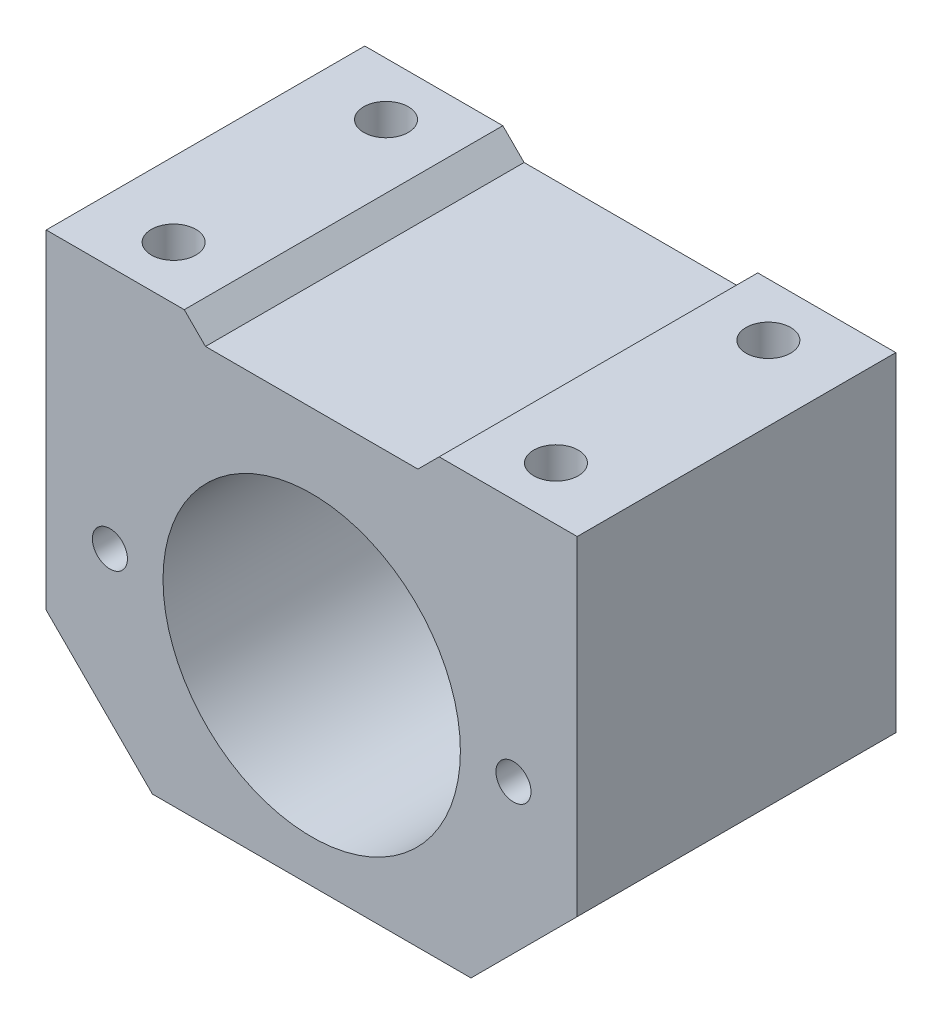
ISO-10303-21;
HEADER;
FILE_DESCRIPTION(('STEP AP214'),'2;1');
FILE_NAME('part.step','',(''),(''),'','','');
FILE_SCHEMA(('AUTOMOTIVE_DESIGN { 1 0 10303 214 1 1 1 1 }'));
ENDSEC;
DATA;
#1=APPLICATION_CONTEXT('core data for automotive mechanical design processes');
#2=APPLICATION_PROTOCOL_DEFINITION('international standard','automotive_design',2000,#1);
#3=PRODUCT_CONTEXT('',#1,'mechanical');
#4=PRODUCT('Part','Part','',(#3));
#5=PRODUCT_RELATED_PRODUCT_CATEGORY('part','',(#4));
#6=PRODUCT_DEFINITION_FORMATION('','',#4);
#7=PRODUCT_DEFINITION_CONTEXT('part definition',#1,'design');
#8=PRODUCT_DEFINITION('design','',#6,#7);
#9=PRODUCT_DEFINITION_SHAPE('','',#8);
#10=(LENGTH_UNIT() NAMED_UNIT(*) SI_UNIT(.MILLI.,.METRE.));
#11=(NAMED_UNIT(*) PLANE_ANGLE_UNIT() SI_UNIT($,.RADIAN.));
#12=(NAMED_UNIT(*) SI_UNIT($,.STERADIAN.) SOLID_ANGLE_UNIT());
#13=UNCERTAINTY_MEASURE_WITH_UNIT(LENGTH_MEASURE(1.E-05),#10,'distance_accuracy_value','');
#14=(GEOMETRIC_REPRESENTATION_CONTEXT(3) GLOBAL_UNCERTAINTY_ASSIGNED_CONTEXT((#13)) GLOBAL_UNIT_ASSIGNED_CONTEXT((#10,
#11,#12)) REPRESENTATION_CONTEXT('',''));
#15=CARTESIAN_POINT('',(0.,0.,0.));
#16=DIRECTION('',(0.,0.,1.));
#17=DIRECTION('',(1.,0.,0.));
#18=AXIS2_PLACEMENT_3D('',#15,#16,#17);
#19=CARTESIAN_POINT('',(-25.,20.5,30.));
#20=DIRECTION('',(0.,-1.,0.));
#21=DIRECTION('',(0.,0.,-1.));
#22=AXIS2_PLACEMENT_3D('',#19,#20,#21);
#23=PLANE('',#22);
#24=CARTESIAN_POINT('',(18.,20.5,4.99999999999999));
#25=DIRECTION('',(0.,1.,0.));
#26=DIRECTION('',(0.,0.,1.));
#27=AXIS2_PLACEMENT_3D('',#24,#25,#26);
#28=CIRCLE('',#27,2.1);
#29=CARTESIAN_POINT('',(18.,20.5,7.09999999999999));
#30=VERTEX_POINT('',#29);
#31=EDGE_CURVE('E150',#30,#30,#28,.T.);
#32=ORIENTED_EDGE('',*,*,#31,.F.);
#33=EDGE_LOOP('',(#32));
#34=FACE_BOUND('',#33,.T.);
#35=CARTESIAN_POINT('',(18.,20.5,25.));
#36=DIRECTION('',(0.,1.,0.));
#37=DIRECTION('',(0.,0.,1.));
#38=AXIS2_PLACEMENT_3D('',#35,#36,#37);
#39=CIRCLE('',#38,2.1);
#40=CARTESIAN_POINT('',(18.,20.5,27.1));
#41=VERTEX_POINT('',#40);
#42=EDGE_CURVE('E156',#41,#41,#39,.T.);
#43=ORIENTED_EDGE('',*,*,#42,.F.);
#44=EDGE_LOOP('',(#43));
#45=FACE_BOUND('',#44,.T.);
#46=DIRECTION('',(-1.,0.,0.));
#47=VECTOR('',#46,1.);
#48=CARTESIAN_POINT('',(-25.,20.5,0.));
#49=LINE('',#48,#47);
#50=CARTESIAN_POINT('',(25.,20.5,0.));
#51=VERTEX_POINT('',#50);
#52=CARTESIAN_POINT('',(12.,20.5,0.));
#53=VERTEX_POINT('',#52);
#54=EDGE_CURVE('E206',#51,#53,#49,.T.);
#55=ORIENTED_EDGE('',*,*,#54,.T.);
#56=DIRECTION('',(0.,0.,1.));
#57=VECTOR('',#56,1.);
#58=CARTESIAN_POINT('',(12.,20.5,30.));
#59=LINE('',#58,#57);
#60=CARTESIAN_POINT('',(12.,20.5,30.));
#61=VERTEX_POINT('',#60);
#62=EDGE_CURVE('E188',#53,#61,#59,.T.);
#63=ORIENTED_EDGE('',*,*,#62,.T.);
#64=DIRECTION('',(-1.,0.,0.));
#65=VECTOR('',#64,1.);
#66=CARTESIAN_POINT('',(-25.,20.5,30.));
#67=LINE('',#66,#65);
#68=CARTESIAN_POINT('',(25.,20.5,30.));
#69=VERTEX_POINT('',#68);
#70=EDGE_CURVE('E196',#69,#61,#67,.T.);
#71=ORIENTED_EDGE('',*,*,#70,.F.);
#72=DIRECTION('',(0.,0.,-1.));
#73=VECTOR('',#72,1.);
#74=CARTESIAN_POINT('',(25.,20.5,30.));
#75=LINE('',#74,#73);
#76=EDGE_CURVE('E214',#69,#51,#75,.T.);
#77=ORIENTED_EDGE('',*,*,#76,.T.);
#78=EDGE_LOOP('',(#55,#63,#71,#77));
#79=FACE_BOUND('',#78,.T.);
#80=ADVANCED_FACE('F39',(#34,#45,#79),#23,.F.);
#81=CARTESIAN_POINT('',(25.,20.5,30.));
#82=DIRECTION('',(-1.,0.,0.));
#83=DIRECTION('',(0.,-1.,0.));
#84=AXIS2_PLACEMENT_3D('',#81,#82,#83);
#85=PLANE('',#84);
#86=DIRECTION('',(0.,1.,0.));
#87=VECTOR('',#86,1.);
#88=CARTESIAN_POINT('',(25.,20.5,30.));
#89=LINE('',#88,#87);
#90=CARTESIAN_POINT('',(25.,-10.5,30.));
#91=VERTEX_POINT('',#90);
#92=EDGE_CURVE('E192',#91,#69,#89,.T.);
#93=ORIENTED_EDGE('',*,*,#92,.F.);
#94=DIRECTION('',(0.,0.,-1.));
#95=VECTOR('',#94,1.);
#96=CARTESIAN_POINT('',(25.,-10.5,30.));
#97=LINE('',#96,#95);
#98=CARTESIAN_POINT('',(25.,-10.5,0.));
#99=VERTEX_POINT('',#98);
#100=EDGE_CURVE('E230',#91,#99,#97,.T.);
#101=ORIENTED_EDGE('',*,*,#100,.T.);
#102=DIRECTION('',(0.,1.,0.));
#103=VECTOR('',#102,1.);
#104=CARTESIAN_POINT('',(25.,20.5,0.));
#105=LINE('',#104,#103);
#106=EDGE_CURVE('E191',#99,#51,#105,.T.);
#107=ORIENTED_EDGE('',*,*,#106,.T.);
#108=ORIENTED_EDGE('',*,*,#76,.F.);
#109=EDGE_LOOP('',(#93,#101,#107,#108));
#110=FACE_BOUND('',#109,.T.);
#111=ADVANCED_FACE('F251',(#110),#85,.F.);
#112=CARTESIAN_POINT('',(-18.,20.5,25.));
#113=DIRECTION('',(0.,1.,0.));
#114=DIRECTION('',(0.,0.,1.));
#115=AXIS2_PLACEMENT_3D('',#112,#113,#114);
#116=CIRCLE('',#115,2.1);
#117=CARTESIAN_POINT('',(-18.,20.5,27.1));
#118=VERTEX_POINT('',#117);
#119=EDGE_CURVE('E140',#118,#118,#116,.T.);
#120=ORIENTED_EDGE('',*,*,#119,.F.);
#121=EDGE_LOOP('',(#120));
#122=FACE_BOUND('',#121,.T.);
#123=CARTESIAN_POINT('',(-18.,20.5,4.99999999999999));
#124=DIRECTION('',(0.,1.,0.));
#125=DIRECTION('',(0.,0.,1.));
#126=AXIS2_PLACEMENT_3D('',#123,#124,#125);
#127=CIRCLE('',#126,2.1);
#128=CARTESIAN_POINT('',(-18.,20.5,7.09999999999999));
#129=VERTEX_POINT('',#128);
#130=EDGE_CURVE('E139',#129,#129,#127,.T.);
#131=ORIENTED_EDGE('',*,*,#130,.F.);
#132=EDGE_LOOP('',(#131));
#133=FACE_BOUND('',#132,.T.);
#134=CARTESIAN_POINT('',(-12.,20.5,30.));
#135=VERTEX_POINT('',#134);
#136=CARTESIAN_POINT('',(-25.,20.5,30.));
#137=VERTEX_POINT('',#136);
#138=EDGE_CURVE('E194',#135,#137,#67,.T.);
#139=ORIENTED_EDGE('',*,*,#138,.F.);
#140=DIRECTION('',(0.,0.,-1.));
#141=VECTOR('',#140,1.);
#142=CARTESIAN_POINT('',(-12.,20.5,30.));
#143=LINE('',#142,#141);
#144=CARTESIAN_POINT('',(-12.,20.5,0.));
#145=VERTEX_POINT('',#144);
#146=EDGE_CURVE('E178',#135,#145,#143,.T.);
#147=ORIENTED_EDGE('',*,*,#146,.T.);
#148=CARTESIAN_POINT('',(-25.,20.5,0.));
#149=VERTEX_POINT('',#148);
#150=EDGE_CURVE('E205',#145,#149,#49,.T.);
#151=ORIENTED_EDGE('',*,*,#150,.T.);
#152=DIRECTION('',(0.,0.,-1.));
#153=VECTOR('',#152,1.);
#154=CARTESIAN_POINT('',(-25.,20.5,30.));
#155=LINE('',#154,#153);
#156=EDGE_CURVE('E203',#137,#149,#155,.T.);
#157=ORIENTED_EDGE('',*,*,#156,.F.);
#158=EDGE_LOOP('',(#139,#147,#151,#157));
#159=FACE_BOUND('',#158,.T.);
#160=ADVANCED_FACE('F268',(#122,#133,#159),#23,.F.);
#161=CARTESIAN_POINT('',(-25.,20.5,30.));
#162=DIRECTION('',(1.,0.,0.));
#163=DIRECTION('',(0.,0.,-1.));
#164=AXIS2_PLACEMENT_3D('',#161,#162,#163);
#165=PLANE('',#164);
#166=DIRECTION('',(0.,-1.,0.));
#167=VECTOR('',#166,1.);
#168=CARTESIAN_POINT('',(-25.,20.5,0.));
#169=LINE('',#168,#167);
#170=CARTESIAN_POINT('',(-25.,-10.5,0.));
#171=VERTEX_POINT('',#170);
#172=EDGE_CURVE('E209',#149,#171,#169,.T.);
#173=ORIENTED_EDGE('',*,*,#172,.T.);
#174=DIRECTION('',(0.,0.,1.));
#175=VECTOR('',#174,1.);
#176=CARTESIAN_POINT('',(-25.,-10.5,30.));
#177=LINE('',#176,#175);
#178=CARTESIAN_POINT('',(-25.,-10.5,30.));
#179=VERTEX_POINT('',#178);
#180=EDGE_CURVE('E11',#171,#179,#177,.T.);
#181=ORIENTED_EDGE('',*,*,#180,.T.);
#182=DIRECTION('',(0.,-1.,0.));
#183=VECTOR('',#182,1.);
#184=CARTESIAN_POINT('',(-25.,20.5,30.));
#185=LINE('',#184,#183);
#186=EDGE_CURVE('E199',#137,#179,#185,.T.);
#187=ORIENTED_EDGE('',*,*,#186,.F.);
#188=ORIENTED_EDGE('',*,*,#156,.T.);
#189=EDGE_LOOP('',(#173,#181,#187,#188));
#190=FACE_BOUND('',#189,.T.);
#191=ADVANCED_FACE('F264',(#190),#165,.F.);
#192=CARTESIAN_POINT('',(-25.,-20.5,30.));
#193=DIRECTION('',(0.,1.,0.));
#194=DIRECTION('',(0.,0.,1.));
#195=AXIS2_PLACEMENT_3D('',#192,#193,#194);
#196=PLANE('',#195);
#197=DIRECTION('',(1.,0.,0.));
#198=VECTOR('',#197,1.);
#199=CARTESIAN_POINT('',(-25.,-20.5,0.));
#200=LINE('',#199,#198);
#201=CARTESIAN_POINT('',(-15.,-20.5,0.));
#202=VERTEX_POINT('',#201);
#203=CARTESIAN_POINT('',(15.,-20.5,0.));
#204=VERTEX_POINT('',#203);
#205=EDGE_CURVE('E195',#202,#204,#200,.T.);
#206=ORIENTED_EDGE('',*,*,#205,.T.);
#207=DIRECTION('',(0.,0.,1.));
#208=VECTOR('',#207,1.);
#209=CARTESIAN_POINT('',(15.,-20.5,30.));
#210=LINE('',#209,#208);
#211=CARTESIAN_POINT('',(15.,-20.5,30.));
#212=VERTEX_POINT('',#211);
#213=EDGE_CURVE('E61',#204,#212,#210,.T.);
#214=ORIENTED_EDGE('',*,*,#213,.T.);
#215=DIRECTION('',(1.,0.,0.));
#216=VECTOR('',#215,1.);
#217=CARTESIAN_POINT('',(-25.,-20.5,30.));
#218=LINE('',#217,#216);
#219=CARTESIAN_POINT('',(-15.,-20.5,30.));
#220=VERTEX_POINT('',#219);
#221=EDGE_CURVE('E201',#220,#212,#218,.T.);
#222=ORIENTED_EDGE('',*,*,#221,.F.);
#223=DIRECTION('',(0.,0.,-1.));
#224=VECTOR('',#223,1.);
#225=CARTESIAN_POINT('',(-15.,-20.5,30.));
#226=LINE('',#225,#224);
#227=EDGE_CURVE('E237',#220,#202,#226,.T.);
#228=ORIENTED_EDGE('',*,*,#227,.T.);
#229=EDGE_LOOP('',(#206,#214,#222,#228));
#230=FACE_BOUND('',#229,.T.);
#231=ADVANCED_FACE('F258',(#230),#196,.F.);
#232=CARTESIAN_POINT('',(0.,0.,30.));
#233=DIRECTION('',(0.,0.,1.));
#234=DIRECTION('',(1.,0.,0.));
#235=AXIS2_PLACEMENT_3D('',#232,#233,#234);
#236=PLANE('',#235);
#237=CARTESIAN_POINT('',(19.,-2.5,30.));
#238=DIRECTION('',(0.,0.,1.));
#239=DIRECTION('',(1.,0.,0.));
#240=AXIS2_PLACEMENT_3D('',#237,#238,#239);
#241=CIRCLE('',#240,1.65);
#242=CARTESIAN_POINT('',(20.65,-2.5,30.));
#243=VERTEX_POINT('',#242);
#244=EDGE_CURVE('E162',#243,#243,#241,.T.);
#245=ORIENTED_EDGE('',*,*,#244,.F.);
#246=EDGE_LOOP('',(#245));
#247=FACE_BOUND('',#246,.T.);
#248=CARTESIAN_POINT('',(-19.,-2.5,30.));
#249=DIRECTION('',(0.,0.,1.));
#250=DIRECTION('',(1.,0.,0.));
#251=AXIS2_PLACEMENT_3D('',#248,#249,#250);
#252=CIRCLE('',#251,1.65);
#253=CARTESIAN_POINT('',(-17.35,-2.5,30.));
#254=VERTEX_POINT('',#253);
#255=EDGE_CURVE('E168',#254,#254,#252,.T.);
#256=ORIENTED_EDGE('',*,*,#255,.F.);
#257=EDGE_LOOP('',(#256));
#258=FACE_BOUND('',#257,.T.);
#259=CARTESIAN_POINT('',(0.,-2.49999999999999,30.));
#260=DIRECTION('',(0.,0.,1.));
#261=DIRECTION('',(1.,0.,0.));
#262=AXIS2_PLACEMENT_3D('',#259,#260,#261);
#263=CIRCLE('',#262,14.);
#264=CARTESIAN_POINT('',(14.,-2.49999999999999,30.));
#265=VERTEX_POINT('',#264);
#266=EDGE_CURVE('E179',#265,#265,#263,.T.);
#267=ORIENTED_EDGE('',*,*,#266,.F.);
#268=EDGE_LOOP('',(#267));
#269=FACE_BOUND('',#268,.T.);
#270=ORIENTED_EDGE('',*,*,#221,.T.);
#271=DIRECTION('',(-0.707106781186549,-0.707106781186546,0.));
#272=VECTOR('',#271,1.);
#273=CARTESIAN_POINT('',(17.75,-17.75,30.));
#274=LINE('',#273,#272);
#275=EDGE_CURVE('E48',#212,#91,#274,.F.);
#276=ORIENTED_EDGE('',*,*,#275,.T.);
#277=ORIENTED_EDGE('',*,*,#92,.T.);
#278=ORIENTED_EDGE('',*,*,#70,.T.);
#279=DIRECTION('',(0.707106781186544,0.707106781186551,0.));
#280=VECTOR('',#279,1.);
#281=CARTESIAN_POINT('',(12.,20.5,30.));
#282=LINE('',#281,#280);
#283=CARTESIAN_POINT('',(10.,18.5,30.));
#284=VERTEX_POINT('',#283);
#285=EDGE_CURVE('E222',#61,#284,#282,.F.);
#286=ORIENTED_EDGE('',*,*,#285,.T.);
#287=DIRECTION('',(1.,0.,0.));
#288=VECTOR('',#287,1.);
#289=CARTESIAN_POINT('',(-12.,18.5,30.));
#290=LINE('',#289,#288);
#291=CARTESIAN_POINT('',(-10.,18.5,30.));
#292=VERTEX_POINT('',#291);
#293=EDGE_CURVE('E174',#292,#284,#290,.T.);
#294=ORIENTED_EDGE('',*,*,#293,.F.);
#295=DIRECTION('',(0.707106781186551,-0.707106781186544,0.));
#296=VECTOR('',#295,1.);
#297=CARTESIAN_POINT('',(-10.,18.5,30.));
#298=LINE('',#297,#296);
#299=EDGE_CURVE('E226',#292,#135,#298,.F.);
#300=ORIENTED_EDGE('',*,*,#299,.T.);
#301=ORIENTED_EDGE('',*,*,#138,.T.);
#302=ORIENTED_EDGE('',*,*,#186,.T.);
#303=DIRECTION('',(-0.707106781186546,0.707106781186549,0.));
#304=VECTOR('',#303,1.);
#305=CARTESIAN_POINT('',(-17.75,-17.75,30.));
#306=LINE('',#305,#304);
#307=EDGE_CURVE('E241',#179,#220,#306,.F.);
#308=ORIENTED_EDGE('',*,*,#307,.T.);
#309=EDGE_LOOP('',(#270,#276,#277,#278,#286,#294,#300,#301,#302,#308));
#310=FACE_BOUND('',#309,.T.);
#311=ADVANCED_FACE('F245',(#247,#258,#269,#310),#236,.T.);
#312=CARTESIAN_POINT('',(0.,0.,0.));
#313=DIRECTION('',(0.,0.,1.));
#314=DIRECTION('',(1.,0.,0.));
#315=AXIS2_PLACEMENT_3D('',#312,#313,#314);
#316=PLANE('',#315);
#317=CARTESIAN_POINT('',(19.,-2.5,0.));
#318=DIRECTION('',(0.,0.,1.));
#319=DIRECTION('',(1.,0.,0.));
#320=AXIS2_PLACEMENT_3D('',#317,#318,#319);
#321=CIRCLE('',#320,1.64999999999999);
#322=CARTESIAN_POINT('',(20.65,-2.5,0.));
#323=VERTEX_POINT('',#322);
#324=EDGE_CURVE('E165',#323,#323,#321,.T.);
#325=ORIENTED_EDGE('',*,*,#324,.T.);
#326=EDGE_LOOP('',(#325));
#327=FACE_BOUND('',#326,.T.);
#328=CARTESIAN_POINT('',(-19.,-2.5,0.));
#329=DIRECTION('',(0.,0.,1.));
#330=DIRECTION('',(1.,0.,0.));
#331=AXIS2_PLACEMENT_3D('',#328,#329,#330);
#332=CIRCLE('',#331,1.64999999999999);
#333=CARTESIAN_POINT('',(-17.35,-2.5,0.));
#334=VERTEX_POINT('',#333);
#335=EDGE_CURVE('E171',#334,#334,#332,.T.);
#336=ORIENTED_EDGE('',*,*,#335,.T.);
#337=EDGE_LOOP('',(#336));
#338=FACE_BOUND('',#337,.T.);
#339=CARTESIAN_POINT('',(0.,-2.49999999999999,0.));
#340=DIRECTION('',(0.,0.,1.));
#341=DIRECTION('',(1.,0.,0.));
#342=AXIS2_PLACEMENT_3D('',#339,#340,#341);
#343=CIRCLE('',#342,14.);
#344=CARTESIAN_POINT('',(14.,-2.49999999999999,0.));
#345=VERTEX_POINT('',#344);
#346=EDGE_CURVE('E175',#345,#345,#343,.T.);
#347=ORIENTED_EDGE('',*,*,#346,.T.);
#348=EDGE_LOOP('',(#347));
#349=FACE_BOUND('',#348,.T.);
#350=ORIENTED_EDGE('',*,*,#106,.F.);
#351=DIRECTION('',(0.707106781186549,0.707106781186546,0.));
#352=VECTOR('',#351,1.);
#353=CARTESIAN_POINT('',(25.,-10.5,0.));
#354=LINE('',#353,#352);
#355=EDGE_CURVE('E235',#99,#204,#354,.F.);
#356=ORIENTED_EDGE('',*,*,#355,.T.);
#357=ORIENTED_EDGE('',*,*,#205,.F.);
#358=DIRECTION('',(0.707106781186546,-0.707106781186549,0.));
#359=VECTOR('',#358,1.);
#360=CARTESIAN_POINT('',(-15.,-20.5,0.));
#361=LINE('',#360,#359);
#362=EDGE_CURVE('E233',#202,#171,#361,.F.);
#363=ORIENTED_EDGE('',*,*,#362,.T.);
#364=ORIENTED_EDGE('',*,*,#172,.F.);
#365=ORIENTED_EDGE('',*,*,#150,.F.);
#366=DIRECTION('',(-0.707106781186551,0.707106781186544,0.));
#367=VECTOR('',#366,1.);
#368=CARTESIAN_POINT('',(4.25000000000005,4.2500000000001,0.));
#369=LINE('',#368,#367);
#370=CARTESIAN_POINT('',(-10.,18.5,0.));
#371=VERTEX_POINT('',#370);
#372=EDGE_CURVE('E228',#145,#371,#369,.F.);
#373=ORIENTED_EDGE('',*,*,#372,.T.);
#374=DIRECTION('',(1.,0.,0.));
#375=VECTOR('',#374,1.);
#376=CARTESIAN_POINT('',(-12.,18.5,0.));
#377=LINE('',#376,#375);
#378=CARTESIAN_POINT('',(10.,18.5,0.));
#379=VERTEX_POINT('',#378);
#380=EDGE_CURVE('E182',#371,#379,#377,.T.);
#381=ORIENTED_EDGE('',*,*,#380,.T.);
#382=DIRECTION('',(-0.707106781186544,-0.707106781186551,0.));
#383=VECTOR('',#382,1.);
#384=CARTESIAN_POINT('',(-4.24999999999994,4.2499999999999,0.));
#385=LINE('',#384,#383);
#386=EDGE_CURVE('E224',#379,#53,#385,.F.);
#387=ORIENTED_EDGE('',*,*,#386,.T.);
#388=ORIENTED_EDGE('',*,*,#54,.F.);
#389=EDGE_LOOP('',(#350,#356,#357,#363,#364,#365,#373,#381,#387,#388));
#390=FACE_BOUND('',#389,.T.);
#391=ADVANCED_FACE('F256',(#327,#338,#349,#390),#316,.F.);
#392=CARTESIAN_POINT('',(-12.,18.5,0.));
#393=DIRECTION('',(0.,-1.,0.));
#394=DIRECTION('',(0.,0.,-1.));
#395=AXIS2_PLACEMENT_3D('',#392,#393,#394);
#396=PLANE('',#395);
#397=ORIENTED_EDGE('',*,*,#293,.T.);
#398=DIRECTION('',(0.,0.,-1.));
#399=VECTOR('',#398,1.);
#400=CARTESIAN_POINT('',(10.,18.5,0.));
#401=LINE('',#400,#399);
#402=EDGE_CURVE('E220',#284,#379,#401,.T.);
#403=ORIENTED_EDGE('',*,*,#402,.T.);
#404=ORIENTED_EDGE('',*,*,#380,.F.);
#405=DIRECTION('',(0.,0.,1.));
#406=VECTOR('',#405,1.);
#407=CARTESIAN_POINT('',(-10.,18.5,30.));
#408=LINE('',#407,#406);
#409=EDGE_CURVE('E217',#371,#292,#408,.T.);
#410=ORIENTED_EDGE('',*,*,#409,.T.);
#411=EDGE_LOOP('',(#397,#403,#404,#410));
#412=FACE_BOUND('',#411,.T.);
#413=ADVANCED_FACE('F277',(#412),#396,.F.);
#414=CARTESIAN_POINT('',(0.,-2.49999999999999,0.));
#415=DIRECTION('',(0.,0.,1.));
#416=DIRECTION('',(1.,0.,0.));
#417=AXIS2_PLACEMENT_3D('',#414,#415,#416);
#418=CYLINDRICAL_SURFACE('',#417,14.);
#419=ORIENTED_EDGE('',*,*,#346,.F.);
#420=EDGE_LOOP('',(#419));
#421=FACE_BOUND('',#420,.T.);
#422=ORIENTED_EDGE('',*,*,#266,.T.);
#423=EDGE_LOOP('',(#422));
#424=FACE_BOUND('',#423,.T.);
#425=ADVANCED_FACE('F338',(#421,#424),#418,.F.);
#426=CARTESIAN_POINT('',(-19.,-2.5,30.));
#427=DIRECTION('',(0.,0.,1.));
#428=DIRECTION('',(1.,0.,0.));
#429=AXIS2_PLACEMENT_3D('',#426,#427,#428);
#430=CYLINDRICAL_SURFACE('',#429,1.64999999999999);
#431=ORIENTED_EDGE('',*,*,#335,.F.);
#432=EDGE_LOOP('',(#431));
#433=FACE_BOUND('',#432,.T.);
#434=ORIENTED_EDGE('',*,*,#255,.T.);
#435=EDGE_LOOP('',(#434));
#436=FACE_BOUND('',#435,.T.);
#437=ADVANCED_FACE('F334',(#433,#436),#430,.F.);
#438=CARTESIAN_POINT('',(19.,-2.5,30.));
#439=DIRECTION('',(0.,0.,1.));
#440=DIRECTION('',(1.,0.,0.));
#441=AXIS2_PLACEMENT_3D('',#438,#439,#440);
#442=CYLINDRICAL_SURFACE('',#441,1.64999999999999);
#443=ORIENTED_EDGE('',*,*,#324,.F.);
#444=EDGE_LOOP('',(#443));
#445=FACE_BOUND('',#444,.T.);
#446=ORIENTED_EDGE('',*,*,#244,.T.);
#447=EDGE_LOOP('',(#446));
#448=FACE_BOUND('',#447,.T.);
#449=ADVANCED_FACE('F330',(#445,#448),#442,.F.);
#450=CARTESIAN_POINT('',(18.,5.5,25.));
#451=DIRECTION('',(0.,1.,0.));
#452=DIRECTION('',(0.,0.,1.));
#453=AXIS2_PLACEMENT_3D('',#450,#451,#452);
#454=CONICAL_SURFACE('',#453,2.1,1.02974425867665);
#455=CARTESIAN_POINT('',(18.,4.23819270004212,25.));
#456=VERTEX_POINT('',#455);
#457=VERTEX_LOOP('',#456);
#458=FACE_BOUND('',#457,.T.);
#459=CARTESIAN_POINT('',(18.,5.5,25.));
#460=DIRECTION('',(0.,1.,0.));
#461=DIRECTION('',(0.,0.,1.));
#462=AXIS2_PLACEMENT_3D('',#459,#460,#461);
#463=CIRCLE('',#462,2.1);
#464=CARTESIAN_POINT('',(18.,5.5,27.1));
#465=VERTEX_POINT('',#464);
#466=EDGE_CURVE('E159',#465,#465,#463,.T.);
#467=ORIENTED_EDGE('',*,*,#466,.T.);
#468=EDGE_LOOP('',(#467));
#469=FACE_BOUND('',#468,.T.);
#470=ADVANCED_FACE('F326',(#458,#469),#454,.F.);
#471=CARTESIAN_POINT('',(18.,20.5,25.));
#472=DIRECTION('',(0.,1.,0.));
#473=DIRECTION('',(0.,0.,1.));
#474=AXIS2_PLACEMENT_3D('',#471,#472,#473);
#475=CYLINDRICAL_SURFACE('',#474,2.1);
#476=ORIENTED_EDGE('',*,*,#466,.F.);
#477=EDGE_LOOP('',(#476));
#478=FACE_BOUND('',#477,.T.);
#479=ORIENTED_EDGE('',*,*,#42,.T.);
#480=EDGE_LOOP('',(#479));
#481=FACE_BOUND('',#480,.T.);
#482=ADVANCED_FACE('F322',(#478,#481),#475,.F.);
#483=CARTESIAN_POINT('',(18.,5.5,4.99999999999999));
#484=DIRECTION('',(0.,1.,0.));
#485=DIRECTION('',(0.,0.,1.));
#486=AXIS2_PLACEMENT_3D('',#483,#484,#485);
#487=CONICAL_SURFACE('',#486,2.09999999999999,1.02974425867665);
#488=CARTESIAN_POINT('',(18.,4.23819270004212,4.99999999999999));
#489=VERTEX_POINT('',#488);
#490=VERTEX_LOOP('',#489);
#491=FACE_BOUND('',#490,.T.);
#492=CARTESIAN_POINT('',(18.,5.5,4.99999999999999));
#493=DIRECTION('',(0.,1.,0.));
#494=DIRECTION('',(0.,0.,1.));
#495=AXIS2_PLACEMENT_3D('',#492,#493,#494);
#496=CIRCLE('',#495,2.09999999999999);
#497=CARTESIAN_POINT('',(18.,5.5,7.09999999999999));
#498=VERTEX_POINT('',#497);
#499=EDGE_CURVE('E153',#498,#498,#496,.T.);
#500=ORIENTED_EDGE('',*,*,#499,.T.);
#501=EDGE_LOOP('',(#500));
#502=FACE_BOUND('',#501,.T.);
#503=ADVANCED_FACE('F318',(#491,#502),#487,.F.);
#504=CARTESIAN_POINT('',(18.,20.5,4.99999999999999));
#505=DIRECTION('',(0.,1.,0.));
#506=DIRECTION('',(0.,0.,1.));
#507=AXIS2_PLACEMENT_3D('',#504,#505,#506);
#508=CYLINDRICAL_SURFACE('',#507,2.1);
#509=ORIENTED_EDGE('',*,*,#499,.F.);
#510=EDGE_LOOP('',(#509));
#511=FACE_BOUND('',#510,.T.);
#512=ORIENTED_EDGE('',*,*,#31,.T.);
#513=EDGE_LOOP('',(#512));
#514=FACE_BOUND('',#513,.T.);
#515=ADVANCED_FACE('F310',(#511,#514),#508,.F.);
#516=CARTESIAN_POINT('',(-18.,5.5,4.99999999999999));
#517=DIRECTION('',(0.,1.,0.));
#518=DIRECTION('',(0.,0.,1.));
#519=AXIS2_PLACEMENT_3D('',#516,#517,#518);
#520=CONICAL_SURFACE('',#519,2.1,1.02974425867665);
#521=CARTESIAN_POINT('',(-18.,4.23819270004212,4.99999999999999));
#522=VERTEX_POINT('',#521);
#523=VERTEX_LOOP('',#522);
#524=FACE_BOUND('',#523,.T.);
#525=CARTESIAN_POINT('',(-18.,5.5,4.99999999999999));
#526=DIRECTION('',(0.,1.,0.));
#527=DIRECTION('',(0.,0.,1.));
#528=AXIS2_PLACEMENT_3D('',#525,#526,#527);
#529=CIRCLE('',#528,2.1);
#530=CARTESIAN_POINT('',(-18.,5.5,7.09999999999999));
#531=VERTEX_POINT('',#530);
#532=EDGE_CURVE('E143',#531,#531,#529,.T.);
#533=ORIENTED_EDGE('',*,*,#532,.T.);
#534=EDGE_LOOP('',(#533));
#535=FACE_BOUND('',#534,.T.);
#536=ADVANCED_FACE('F304',(#524,#535),#520,.F.);
#537=CARTESIAN_POINT('',(-18.,20.5,4.99999999999999));
#538=DIRECTION('',(0.,1.,0.));
#539=DIRECTION('',(0.,0.,1.));
#540=AXIS2_PLACEMENT_3D('',#537,#538,#539);
#541=CYLINDRICAL_SURFACE('',#540,2.1);
#542=ORIENTED_EDGE('',*,*,#532,.F.);
#543=EDGE_LOOP('',(#542));
#544=FACE_BOUND('',#543,.T.);
#545=ORIENTED_EDGE('',*,*,#130,.T.);
#546=EDGE_LOOP('',(#545));
#547=FACE_BOUND('',#546,.T.);
#548=ADVANCED_FACE('F133',(#544,#547),#541,.F.);
#549=CARTESIAN_POINT('',(-18.,5.5,25.));
#550=DIRECTION('',(0.,1.,0.));
#551=DIRECTION('',(0.,0.,1.));
#552=AXIS2_PLACEMENT_3D('',#549,#550,#551);
#553=CONICAL_SURFACE('',#552,2.1,1.02974425867665);
#554=CARTESIAN_POINT('',(-18.,4.23819270004212,25.));
#555=VERTEX_POINT('',#554);
#556=VERTEX_LOOP('',#555);
#557=FACE_BOUND('',#556,.T.);
#558=CARTESIAN_POINT('',(-18.,5.5,25.));
#559=DIRECTION('',(0.,1.,0.));
#560=DIRECTION('',(0.,0.,1.));
#561=AXIS2_PLACEMENT_3D('',#558,#559,#560);
#562=CIRCLE('',#561,2.1);
#563=CARTESIAN_POINT('',(-18.,5.5,27.1));
#564=VERTEX_POINT('',#563);
#565=EDGE_CURVE('E137',#564,#564,#562,.T.);
#566=ORIENTED_EDGE('',*,*,#565,.T.);
#567=EDGE_LOOP('',(#566));
#568=FACE_BOUND('',#567,.T.);
#569=ADVANCED_FACE('F129',(#557,#568),#553,.F.);
#570=CARTESIAN_POINT('',(-18.,20.5,25.));
#571=DIRECTION('',(0.,1.,0.));
#572=DIRECTION('',(0.,0.,1.));
#573=AXIS2_PLACEMENT_3D('',#570,#571,#572);
#574=CYLINDRICAL_SURFACE('',#573,2.1);
#575=ORIENTED_EDGE('',*,*,#565,.F.);
#576=EDGE_LOOP('',(#575));
#577=FACE_BOUND('',#576,.T.);
#578=ORIENTED_EDGE('',*,*,#119,.T.);
#579=EDGE_LOOP('',(#578));
#580=FACE_BOUND('',#579,.T.);
#581=ADVANCED_FACE('F132',(#577,#580),#574,.F.);
#582=CARTESIAN_POINT('',(12.,20.5,0.));
#583=DIRECTION('',(-0.707106781186551,0.707106781186544,0.));
#584=DIRECTION('',(0.,0.,-1.));
#585=AXIS2_PLACEMENT_3D('',#582,#583,#584);
#586=PLANE('',#585);
#587=ORIENTED_EDGE('',*,*,#386,.F.);
#588=ORIENTED_EDGE('',*,*,#402,.F.);
#589=ORIENTED_EDGE('',*,*,#285,.F.);
#590=ORIENTED_EDGE('',*,*,#62,.F.);
#591=EDGE_LOOP('',(#587,#588,#589,#590));
#592=FACE_BOUND('',#591,.T.);
#593=ADVANCED_FACE('F282',(#592),#586,.T.);
#594=CARTESIAN_POINT('',(-10.,18.5,0.));
#595=DIRECTION('',(0.707106781186544,0.707106781186551,0.));
#596=DIRECTION('',(0.,0.,-1.));
#597=AXIS2_PLACEMENT_3D('',#594,#595,#596);
#598=PLANE('',#597);
#599=ORIENTED_EDGE('',*,*,#372,.F.);
#600=ORIENTED_EDGE('',*,*,#146,.F.);
#601=ORIENTED_EDGE('',*,*,#299,.F.);
#602=ORIENTED_EDGE('',*,*,#409,.F.);
#603=EDGE_LOOP('',(#599,#600,#601,#602));
#604=FACE_BOUND('',#603,.T.);
#605=ADVANCED_FACE('F274',(#604),#598,.T.);
#606=CARTESIAN_POINT('',(25.,-10.5,30.));
#607=DIRECTION('',(-0.707106781186546,0.707106781186549,0.));
#608=DIRECTION('',(0.,0.,-1.));
#609=AXIS2_PLACEMENT_3D('',#606,#607,#608);
#610=PLANE('',#609);
#611=ORIENTED_EDGE('',*,*,#275,.F.);
#612=ORIENTED_EDGE('',*,*,#213,.F.);
#613=ORIENTED_EDGE('',*,*,#355,.F.);
#614=ORIENTED_EDGE('',*,*,#100,.F.);
#615=EDGE_LOOP('',(#611,#612,#613,#614));
#616=FACE_BOUND('',#615,.T.);
#617=ADVANCED_FACE('F253',(#616),#610,.F.);
#618=CARTESIAN_POINT('',(-15.,-20.5,30.));
#619=DIRECTION('',(0.707106781186549,0.707106781186546,0.));
#620=DIRECTION('',(0.,0.,-1.));
#621=AXIS2_PLACEMENT_3D('',#618,#619,#620);
#622=PLANE('',#621);
#623=ORIENTED_EDGE('',*,*,#307,.F.);
#624=ORIENTED_EDGE('',*,*,#180,.F.);
#625=ORIENTED_EDGE('',*,*,#362,.F.);
#626=ORIENTED_EDGE('',*,*,#227,.F.);
#627=EDGE_LOOP('',(#623,#624,#625,#626));
#628=FACE_BOUND('',#627,.T.);
#629=ADVANCED_FACE('F42',(#628),#622,.F.);
#630=CLOSED_SHELL('',(#80,#111,#160,#191,#231,#311,#391,#413,#425,#437,#449,#470,#482,#503,#515,
#536,#548,#569,#581,#593,#605,#617,#629));
#631=MANIFOLD_SOLID_BREP('B2',#630);
#632=ADVANCED_BREP_SHAPE_REPRESENTATION('',(#18,#631),#14);
#633=SHAPE_DEFINITION_REPRESENTATION(#9,#632);
ENDSEC;
END-ISO-10303-21;
